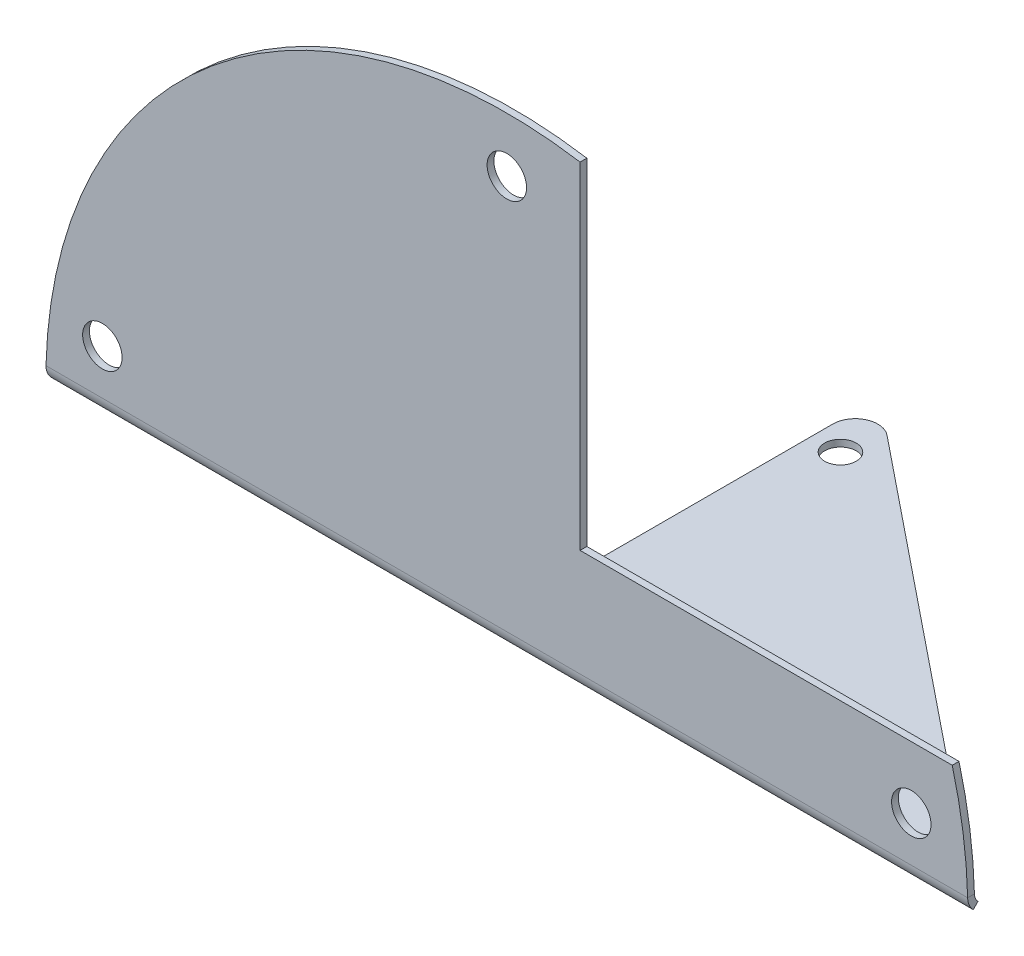
ISO-10303-21;
HEADER;
FILE_DESCRIPTION(('STEP AP214'),'2;1');
FILE_NAME('part.step','',(''),(''),'','','');
FILE_SCHEMA(('AUTOMOTIVE_DESIGN { 1 0 10303 214 1 1 1 1 }'));
ENDSEC;
DATA;
#1=APPLICATION_CONTEXT('core data for automotive mechanical design processes');
#2=APPLICATION_PROTOCOL_DEFINITION('international standard','automotive_design',2000,#1);
#3=PRODUCT_CONTEXT('',#1,'mechanical');
#4=PRODUCT('Part','Part','',(#3));
#5=PRODUCT_RELATED_PRODUCT_CATEGORY('part','',(#4));
#6=PRODUCT_DEFINITION_FORMATION('','',#4);
#7=PRODUCT_DEFINITION_CONTEXT('part definition',#1,'design');
#8=PRODUCT_DEFINITION('design','',#6,#7);
#9=PRODUCT_DEFINITION_SHAPE('','',#8);
#10=(LENGTH_UNIT() NAMED_UNIT(*) SI_UNIT(.MILLI.,.METRE.));
#11=(NAMED_UNIT(*) PLANE_ANGLE_UNIT() SI_UNIT($,.RADIAN.));
#12=(NAMED_UNIT(*) SI_UNIT($,.STERADIAN.) SOLID_ANGLE_UNIT());
#13=UNCERTAINTY_MEASURE_WITH_UNIT(LENGTH_MEASURE(1.E-05),#10,'distance_accuracy_value','');
#14=(GEOMETRIC_REPRESENTATION_CONTEXT(3) GLOBAL_UNCERTAINTY_ASSIGNED_CONTEXT((#13)) GLOBAL_UNIT_ASSIGNED_CONTEXT((#10,
#11,#12)) REPRESENTATION_CONTEXT('',''));
#15=CARTESIAN_POINT('',(0.,0.,0.));
#16=DIRECTION('',(0.,0.,1.));
#17=DIRECTION('',(1.,0.,0.));
#18=AXIS2_PLACEMENT_3D('',#15,#16,#17);
#19=CARTESIAN_POINT('',(0.,-0.0420352248333679,0.600000000000007));
#20=DIRECTION('',(0.,0.,-1.));
#21=DIRECTION('',(0.,1.,0.));
#22=AXIS2_PLACEMENT_3D('',#19,#20,#21);
#23=PLANE('',#22);
#24=CARTESIAN_POINT('',(-35.8867235492184,5.00000000000001,0.599999999999989));
#25=DIRECTION('',(0.,0.,1.));
#26=DIRECTION('',(0.,1.,0.));
#27=AXIS2_PLACEMENT_3D('',#24,#25,#26);
#28=CIRCLE('',#27,1.75);
#29=CARTESIAN_POINT('',(-35.8867235492184,6.75000000000001,0.599999999999983));
#30=VERTEX_POINT('',#29);
#31=EDGE_CURVE('E421',#30,#30,#28,.F.);
#32=ORIENTED_EDGE('',*,*,#31,.T.);
#33=EDGE_LOOP('',(#32));
#34=FACE_BOUND('',#33,.T.);
#35=CARTESIAN_POINT('',(35.8867235492184,5.00000000000001,0.599999999999989));
#36=DIRECTION('',(0.,0.,1.));
#37=DIRECTION('',(0.,1.,0.));
#38=AXIS2_PLACEMENT_3D('',#35,#36,#37);
#39=CIRCLE('',#38,1.75);
#40=CARTESIAN_POINT('',(35.8867235492184,6.75000000000001,0.599999999999983));
#41=VERTEX_POINT('',#40);
#42=EDGE_CURVE('E425',#41,#41,#39,.T.);
#43=ORIENTED_EDGE('',*,*,#42,.F.);
#44=EDGE_LOOP('',(#43));
#45=FACE_BOUND('',#44,.T.);
#46=CARTESIAN_POINT('',(0.,36.,0.59999999999988));
#47=DIRECTION('',(0.,0.,1.));
#48=DIRECTION('',(0.,1.,0.));
#49=AXIS2_PLACEMENT_3D('',#46,#47,#48);
#50=CIRCLE('',#49,1.75);
#51=CARTESIAN_POINT('',(0.,37.75,0.599999999999874));
#52=VERTEX_POINT('',#51);
#53=EDGE_CURVE('E429',#52,#52,#50,.T.);
#54=ORIENTED_EDGE('',*,*,#53,.F.);
#55=EDGE_LOOP('',(#54));
#56=FACE_BOUND('',#55,.T.);
#57=DIRECTION('',(0.,1.,0.));
#58=VECTOR('',#57,1.);
#59=CARTESIAN_POINT('',(6.5,-0.0420352248333679,0.600000000000007));
#60=LINE('',#59,#58);
#61=CARTESIAN_POINT('',(6.5,10.5,0.59999999999997));
#62=VERTEX_POINT('',#61);
#63=CARTESIAN_POINT('',(6.5,40.3381579396377,0.599999999999866));
#64=VERTEX_POINT('',#63);
#65=EDGE_CURVE('E555',#62,#64,#60,.T.);
#66=ORIENTED_EDGE('',*,*,#65,.T.);
#67=CARTESIAN_POINT('',(0.,-0.0420352248333679,0.600000000000007));
#68=DIRECTION('',(0.,0.,1.));
#69=DIRECTION('',(0.,1.,0.));
#70=AXIS2_PLACEMENT_3D('',#67,#68,#69);
#71=CIRCLE('',#70,40.9);
#72=CARTESIAN_POINT('',(-40.8867235492184,1.00000000000001,0.600000000000003));
#73=VERTEX_POINT('',#72);
#74=EDGE_CURVE('E64',#64,#73,#71,.T.);
#75=ORIENTED_EDGE('',*,*,#74,.T.);
#76=DIRECTION('',(1.,0.,0.));
#77=VECTOR('',#76,1.);
#78=CARTESIAN_POINT('',(0.,1.00000000000001,0.600000000000003));
#79=LINE('',#78,#77);
#80=CARTESIAN_POINT('',(40.8867235492184,1.00000000000001,0.600000000000004));
#81=VERTEX_POINT('',#80);
#82=EDGE_CURVE('E438',#73,#81,#79,.T.);
#83=ORIENTED_EDGE('',*,*,#82,.T.);
#84=CARTESIAN_POINT('',(39.5180400996605,10.5,0.59999999999997));
#85=VERTEX_POINT('',#84);
#86=EDGE_CURVE('E516',#81,#85,#71,.T.);
#87=ORIENTED_EDGE('',*,*,#86,.T.);
#88=DIRECTION('',(-1.,0.,0.));
#89=VECTOR('',#88,1.);
#90=CARTESIAN_POINT('',(0.,10.5,0.59999999999997));
#91=LINE('',#90,#89);
#92=EDGE_CURVE('E78',#85,#62,#91,.T.);
#93=ORIENTED_EDGE('',*,*,#92,.T.);
#94=EDGE_LOOP('',(#66,#75,#83,#87,#93));
#95=FACE_BOUND('',#94,.T.);
#96=ADVANCED_FACE('F60',(#34,#45,#56,#95),#23,.F.);
#97=CARTESIAN_POINT('',(0.,-0.04203522483337,0.));
#98=DIRECTION('',(0.,0.,-1.));
#99=DIRECTION('',(0.,1.,0.));
#100=AXIS2_PLACEMENT_3D('',#97,#98,#99);
#101=PLANE('',#100);
#102=CARTESIAN_POINT('',(-35.8867235492184,5.,0.));
#103=DIRECTION('',(0.,0.,-1.));
#104=DIRECTION('',(0.,1.,0.));
#105=AXIS2_PLACEMENT_3D('',#102,#103,#104);
#106=CIRCLE('',#105,1.75);
#107=CARTESIAN_POINT('',(-35.8867235492184,6.75000000000001,0.));
#108=VERTEX_POINT('',#107);
#109=EDGE_CURVE('E388',#108,#108,#106,.T.);
#110=ORIENTED_EDGE('',*,*,#109,.F.);
#111=EDGE_LOOP('',(#110));
#112=FACE_BOUND('',#111,.T.);
#113=CARTESIAN_POINT('',(35.8867235492184,5.,0.));
#114=DIRECTION('',(0.,0.,1.));
#115=DIRECTION('',(0.,1.,0.));
#116=AXIS2_PLACEMENT_3D('',#113,#114,#115);
#117=CIRCLE('',#116,1.75);
#118=CARTESIAN_POINT('',(35.8867235492184,6.75000000000001,0.));
#119=VERTEX_POINT('',#118);
#120=EDGE_CURVE('E392',#119,#119,#117,.T.);
#121=ORIENTED_EDGE('',*,*,#120,.T.);
#122=EDGE_LOOP('',(#121));
#123=FACE_BOUND('',#122,.T.);
#124=CARTESIAN_POINT('',(0.,36.,-1.25693328198353E-13));
#125=DIRECTION('',(0.,0.,1.));
#126=DIRECTION('',(0.,1.,0.));
#127=AXIS2_PLACEMENT_3D('',#124,#125,#126);
#128=CIRCLE('',#127,1.75);
#129=CARTESIAN_POINT('',(0.,37.75,-1.31803420541328E-13));
#130=VERTEX_POINT('',#129);
#131=EDGE_CURVE('E396',#130,#130,#128,.T.);
#132=ORIENTED_EDGE('',*,*,#131,.T.);
#133=EDGE_LOOP('',(#132));
#134=FACE_BOUND('',#133,.T.);
#135=CARTESIAN_POINT('',(0.,-0.04203522483337,0.));
#136=DIRECTION('',(0.,0.,1.));
#137=DIRECTION('',(0.,1.,0.));
#138=AXIS2_PLACEMENT_3D('',#135,#136,#137);
#139=CIRCLE('',#138,40.9);
#140=CARTESIAN_POINT('',(6.5,40.3381579396377,-1.33939376771476E-13));
#141=VERTEX_POINT('',#140);
#142=CARTESIAN_POINT('',(-40.8867235492184,1.,0.));
#143=VERTEX_POINT('',#142);
#144=EDGE_CURVE('E348',#141,#143,#139,.T.);
#145=ORIENTED_EDGE('',*,*,#144,.F.);
#146=DIRECTION('',(0.,1.,0.));
#147=VECTOR('',#146,1.);
#148=CARTESIAN_POINT('',(6.5,-0.04203522483337,0.));
#149=LINE('',#148,#147);
#150=CARTESIAN_POINT('',(6.5,10.5,0.));
#151=VERTEX_POINT('',#150);
#152=EDGE_CURVE('E402',#151,#141,#149,.T.);
#153=ORIENTED_EDGE('',*,*,#152,.F.);
#154=DIRECTION('',(1.,0.,0.));
#155=VECTOR('',#154,1.);
#156=CARTESIAN_POINT('',(0.,10.5,0.));
#157=LINE('',#156,#155);
#158=CARTESIAN_POINT('',(39.5180400996605,10.5,0.));
#159=VERTEX_POINT('',#158);
#160=EDGE_CURVE('E415',#159,#151,#157,.F.);
#161=ORIENTED_EDGE('',*,*,#160,.F.);
#162=CARTESIAN_POINT('',(40.8867235492184,1.,0.));
#163=VERTEX_POINT('',#162);
#164=EDGE_CURVE('E345',#163,#159,#139,.T.);
#165=ORIENTED_EDGE('',*,*,#164,.F.);
#166=DIRECTION('',(1.,0.,0.));
#167=VECTOR('',#166,1.);
#168=CARTESIAN_POINT('',(0.,1.,0.));
#169=LINE('',#168,#167);
#170=EDGE_CURVE('E343',#143,#163,#169,.T.);
#171=ORIENTED_EDGE('',*,*,#170,.F.);
#172=EDGE_LOOP('',(#145,#153,#161,#165,#171));
#173=FACE_BOUND('',#172,.T.);
#174=ADVANCED_FACE('F375',(#112,#123,#134,#173),#101,.T.);
#175=CARTESIAN_POINT('',(0.,-0.0420352248333679,0.600000000000007));
#176=DIRECTION('',(0.,0.,-1.));
#177=DIRECTION('',(0.,1.,0.));
#178=AXIS2_PLACEMENT_3D('',#175,#176,#177);
#179=CYLINDRICAL_SURFACE('',#178,40.9);
#180=ORIENTED_EDGE('',*,*,#74,.F.);
#181=DIRECTION('',(0.,0.,1.));
#182=VECTOR('',#181,1.);
#183=CARTESIAN_POINT('',(6.5,40.3381579396377,0.599999999999866));
#184=LINE('',#183,#182);
#185=EDGE_CURVE('E407',#64,#141,#184,.F.);
#186=ORIENTED_EDGE('',*,*,#185,.T.);
#187=ORIENTED_EDGE('',*,*,#144,.T.);
#188=CARTESIAN_POINT('',(-40.8867235492184,1.,0.600000000000003));
#189=CARTESIAN_POINT('',(-40.8867235492184,1.,0.));
#190=B_SPLINE_CURVE_WITH_KNOTS('',1,(#188,#189),.UNSPECIFIED.,.F.,.F.,(2,2),(0.,1.),.UNSPECIFIED.);
#191=EDGE_CURVE('E362',#73,#143,#190,.T.);
#192=ORIENTED_EDGE('',*,*,#191,.F.);
#193=EDGE_LOOP('',(#180,#186,#187,#192));
#194=FACE_BOUND('',#193,.T.);
#195=ADVANCED_FACE('F365',(#194),#179,.T.);
#196=ORIENTED_EDGE('',*,*,#164,.T.);
#197=DIRECTION('',(0.,0.,1.));
#198=VECTOR('',#197,1.);
#199=CARTESIAN_POINT('',(39.5180400996605,10.5,0.59999999999997));
#200=LINE('',#199,#198);
#201=EDGE_CURVE('E410',#85,#159,#200,.F.);
#202=ORIENTED_EDGE('',*,*,#201,.F.);
#203=ORIENTED_EDGE('',*,*,#86,.F.);
#204=CARTESIAN_POINT('',(40.8867235492184,1.,0.));
#205=CARTESIAN_POINT('',(40.8867235492184,1.,0.600000000000003));
#206=B_SPLINE_CURVE_WITH_KNOTS('',1,(#204,#205),.UNSPECIFIED.,.F.,.F.,(2,2),(0.,1.),.UNSPECIFIED.);
#207=EDGE_CURVE('E193',#163,#81,#206,.T.);
#208=ORIENTED_EDGE('',*,*,#207,.F.);
#209=EDGE_LOOP('',(#196,#202,#203,#208));
#210=FACE_BOUND('',#209,.T.);
#211=ADVANCED_FACE('F374',(#210),#179,.T.);
#212=CARTESIAN_POINT('',(-0.5,-0.6,-30.817766741711));
#213=DIRECTION('',(0.,1.,0.));
#214=DIRECTION('',(0.,0.,1.));
#215=AXIS2_PLACEMENT_3D('',#212,#213,#214);
#216=CYLINDRICAL_SURFACE('',#215,2.);
#217=CARTESIAN_POINT('',(-0.5,0.,-30.817766741711));
#218=DIRECTION('',(0.,-1.,0.));
#219=DIRECTION('',(0.,0.,-1.));
#220=AXIS2_PLACEMENT_3D('',#217,#218,#219);
#221=CIRCLE('',#220,2.);
#222=CARTESIAN_POINT('',(-2.5,0.,-30.817766741711));
#223=VERTEX_POINT('',#222);
#224=CARTESIAN_POINT('',(0.755504902379564,0.,-32.3745928206616));
#225=VERTEX_POINT('',#224);
#226=EDGE_CURVE('E461',#223,#225,#221,.T.);
#227=ORIENTED_EDGE('',*,*,#226,.T.);
#228=DIRECTION('',(0.,1.,0.));
#229=VECTOR('',#228,1.);
#230=CARTESIAN_POINT('',(0.755504902379564,-0.6,-32.3745928206616));
#231=LINE('',#230,#229);
#232=CARTESIAN_POINT('',(0.755504902379564,-0.6,-32.3745928206616));
#233=VERTEX_POINT('',#232);
#234=EDGE_CURVE('E467',#233,#225,#231,.T.);
#235=ORIENTED_EDGE('',*,*,#234,.F.);
#236=CARTESIAN_POINT('',(-0.5,-0.6,-30.817766741711));
#237=DIRECTION('',(0.,-1.,0.));
#238=DIRECTION('',(0.,0.,-1.));
#239=AXIS2_PLACEMENT_3D('',#236,#237,#238);
#240=CIRCLE('',#239,2.);
#241=CARTESIAN_POINT('',(-2.5,-0.6,-30.817766741711));
#242=VERTEX_POINT('',#241);
#243=EDGE_CURVE('E470',#242,#233,#240,.T.);
#244=ORIENTED_EDGE('',*,*,#243,.F.);
#245=DIRECTION('',(0.,1.,0.));
#246=VECTOR('',#245,1.);
#247=CARTESIAN_POINT('',(-2.5,-0.6,-30.817766741711));
#248=LINE('',#247,#246);
#249=EDGE_CURVE('E12',#242,#223,#248,.T.);
#250=ORIENTED_EDGE('',*,*,#249,.T.);
#251=EDGE_LOOP('',(#227,#235,#244,#250));
#252=FACE_BOUND('',#251,.T.);
#253=ADVANCED_FACE('F538',(#252),#216,.T.);
#254=CARTESIAN_POINT('',(0.,-0.6,0.));
#255=DIRECTION('',(0.,1.,0.));
#256=DIRECTION('',(0.,0.,1.));
#257=AXIS2_PLACEMENT_3D('',#254,#255,#256);
#258=PLANE('',#257);
#259=CARTESIAN_POINT('',(0.,-0.6,-29.));
#260=DIRECTION('',(0.,-1.,0.));
#261=DIRECTION('',(0.,0.,1.));
#262=AXIS2_PLACEMENT_3D('',#259,#260,#261);
#263=CIRCLE('',#262,1.4);
#264=CARTESIAN_POINT('',(0.,-0.6,-27.6));
#265=VERTEX_POINT('',#264);
#266=EDGE_CURVE('E435',#265,#265,#263,.T.);
#267=ORIENTED_EDGE('',*,*,#266,.F.);
#268=EDGE_LOOP('',(#267));
#269=FACE_BOUND('',#268,.T.);
#270=DIRECTION('',(0.,0.,-1.));
#271=VECTOR('',#270,1.);
#272=CARTESIAN_POINT('',(-2.5,-0.6,0.));
#273=LINE('',#272,#271);
#274=CARTESIAN_POINT('',(-2.5,-0.6,-0.999999999999997));
#275=VERTEX_POINT('',#274);
#276=EDGE_CURVE('E70',#275,#242,#273,.T.);
#277=ORIENTED_EDGE('',*,*,#276,.T.);
#278=ORIENTED_EDGE('',*,*,#243,.T.);
#279=DIRECTION('',(0.778413039475329,0.,0.627752451189782));
#280=VECTOR('',#279,1.);
#281=CARTESIAN_POINT('',(40.9,-0.6,0.));
#282=LINE('',#281,#280);
#283=CARTESIAN_POINT('',(39.66,-0.6,-0.999999999999998));
#284=VERTEX_POINT('',#283);
#285=EDGE_CURVE('E466',#233,#284,#282,.T.);
#286=ORIENTED_EDGE('',*,*,#285,.T.);
#287=DIRECTION('',(1.,0.,0.));
#288=VECTOR('',#287,1.);
#289=CARTESIAN_POINT('',(0.,-0.6,-0.999999999999997));
#290=LINE('',#289,#288);
#291=EDGE_CURVE('E168',#275,#284,#290,.T.);
#292=ORIENTED_EDGE('',*,*,#291,.F.);
#293=EDGE_LOOP('',(#277,#278,#286,#292));
#294=FACE_BOUND('',#293,.T.);
#295=ADVANCED_FACE('F498',(#269,#294),#258,.F.);
#296=CARTESIAN_POINT('',(40.9,-0.6,0.));
#297=DIRECTION('',(0.627752451189782,0.,-0.778413039475329));
#298=DIRECTION('',(0.778413039475329,0.,0.627752451189782));
#299=AXIS2_PLACEMENT_3D('',#296,#297,#298);
#300=PLANE('',#299);
#301=CARTESIAN_POINT('',(39.66,-0.6,-0.999999999999998));
#302=CARTESIAN_POINT('',(39.66,0.,-0.999999999999998));
#303=B_SPLINE_CURVE_WITH_KNOTS('',1,(#301,#302),.UNSPECIFIED.,.F.,.F.,(2,2),(0.,1.),.UNSPECIFIED.);
#304=CARTESIAN_POINT('',(39.66,0.,-0.999999999999998));
#305=VERTEX_POINT('',#304);
#306=EDGE_CURVE('E258',#305,#284,#303,.F.);
#307=ORIENTED_EDGE('',*,*,#306,.T.);
#308=ORIENTED_EDGE('',*,*,#285,.F.);
#309=ORIENTED_EDGE('',*,*,#234,.T.);
#310=DIRECTION('',(0.778413039475329,0.,0.627752451189782));
#311=VECTOR('',#310,1.);
#312=CARTESIAN_POINT('',(40.9,0.,0.));
#313=LINE('',#312,#311);
#314=EDGE_CURVE('E460',#225,#305,#313,.T.);
#315=ORIENTED_EDGE('',*,*,#314,.T.);
#316=EDGE_LOOP('',(#307,#308,#309,#315));
#317=FACE_BOUND('',#316,.T.);
#318=ADVANCED_FACE('F488',(#317),#300,.T.);
#319=CARTESIAN_POINT('',(0.,0.,0.));
#320=DIRECTION('',(0.,1.,0.));
#321=DIRECTION('',(0.,0.,1.));
#322=AXIS2_PLACEMENT_3D('',#319,#320,#321);
#323=PLANE('',#322);
#324=CARTESIAN_POINT('',(0.,0.,-29.));
#325=DIRECTION('',(0.,-1.,0.));
#326=DIRECTION('',(0.,0.,1.));
#327=AXIS2_PLACEMENT_3D('',#324,#325,#326);
#328=CIRCLE('',#327,1.4);
#329=CARTESIAN_POINT('',(0.,0.,-27.6));
#330=VERTEX_POINT('',#329);
#331=EDGE_CURVE('E432',#330,#330,#328,.T.);
#332=ORIENTED_EDGE('',*,*,#331,.T.);
#333=EDGE_LOOP('',(#332));
#334=FACE_BOUND('',#333,.T.);
#335=DIRECTION('',(1.,0.,0.));
#336=VECTOR('',#335,1.);
#337=CARTESIAN_POINT('',(0.,0.,-0.999999999999997));
#338=LINE('',#337,#336);
#339=CARTESIAN_POINT('',(-2.5,0.,-0.999999999999997));
#340=VERTEX_POINT('',#339);
#341=EDGE_CURVE('E448',#340,#305,#338,.T.);
#342=ORIENTED_EDGE('',*,*,#341,.T.);
#343=ORIENTED_EDGE('',*,*,#314,.F.);
#344=ORIENTED_EDGE('',*,*,#226,.F.);
#345=DIRECTION('',(0.,0.,-1.));
#346=VECTOR('',#345,1.);
#347=CARTESIAN_POINT('',(-2.5,0.,0.));
#348=LINE('',#347,#346);
#349=EDGE_CURVE('E464',#340,#223,#348,.T.);
#350=ORIENTED_EDGE('',*,*,#349,.F.);
#351=EDGE_LOOP('',(#342,#343,#344,#350));
#352=FACE_BOUND('',#351,.T.);
#353=ADVANCED_FACE('F497',(#334,#352),#323,.T.);
#354=CARTESIAN_POINT('',(-2.5,-0.6,0.));
#355=DIRECTION('',(-1.,0.,0.));
#356=DIRECTION('',(0.,0.,-1.));
#357=AXIS2_PLACEMENT_3D('',#354,#355,#356);
#358=PLANE('',#357);
#359=DIRECTION('',(0.,1.,0.));
#360=VECTOR('',#359,1.);
#361=CARTESIAN_POINT('',(-2.5,-0.6,-0.999999999999997));
#362=LINE('',#361,#360);
#363=EDGE_CURVE('E472',#275,#340,#362,.T.);
#364=ORIENTED_EDGE('',*,*,#363,.T.);
#365=ORIENTED_EDGE('',*,*,#349,.T.);
#366=ORIENTED_EDGE('',*,*,#249,.F.);
#367=ORIENTED_EDGE('',*,*,#276,.F.);
#368=EDGE_LOOP('',(#364,#365,#366,#367));
#369=FACE_BOUND('',#368,.T.);
#370=ADVANCED_FACE('F62',(#369),#358,.T.);
#371=CARTESIAN_POINT('',(-40.9,-0.149513513285818,0.112932469996856));
#372=CARTESIAN_POINT('',(-40.89778682558,-0.000803054612772406,0.26653090154597));
#373=CARTESIAN_POINT('',(-40.8955745164061,0.178964943287356,0.389816839267624));
#374=CARTESIAN_POINT('',(-40.8911490328122,0.572589584931808,0.556601987713694));
#375=CARTESIAN_POINT('',(-40.8889367236384,0.786207393268396,0.600000000000003));
#376=CARTESIAN_POINT('',(-40.8867235492184,1.,0.600000000000003));
#377=CARTESIAN_POINT('',(-40.9,0.281554054196364,-0.304417206251963));
#378=CARTESIAN_POINT('',(-40.8977868256523,0.374498087830562,-0.208418189670029));
#379=CARTESIAN_POINT('',(-40.8955745164061,0.486853089554597,-0.131364475457734));
#380=CARTESIAN_POINT('',(-40.8911490328122,0.73286849058238,-0.0271237576789403));
#381=CARTESIAN_POINT('',(-40.8889367235661,0.866379625158088,0.));
#382=CARTESIAN_POINT('',(-40.8867235492184,1.,0.));
#383=B_SPLINE_SURFACE_WITH_KNOTS('',1,3,((#371,#372,#373,#374,#375,#376),(#377,#378,#379,#380,
#381,#382)),.UNSPECIFIED.,.F.,.F.,.F.,(2,2),(4,2,4),(0.,1.),(0.,0.5,1.),.UNSPECIFIED.);
#384=CARTESIAN_POINT('',(-40.9,0.281554054196364,-0.304417206251963));
#385=CARTESIAN_POINT('',(-40.9,-0.149513513285818,0.112932469996856));
#386=B_SPLINE_CURVE_WITH_KNOTS('',1,(#384,#385),.UNSPECIFIED.,.F.,.F.,(2,2),(0.,1.),.UNSPECIFIED.);
#387=CARTESIAN_POINT('',(-40.9,0.281554054196364,-0.304417206251963));
#388=VERTEX_POINT('',#387);
#389=CARTESIAN_POINT('',(-40.9,-0.149513513285818,0.112932469996856));
#390=VERTEX_POINT('',#389);
#391=EDGE_CURVE('E186',#388,#390,#386,.T.);
#392=CARTESIAN_POINT('',(-40.9,-0.149513513285818,0.112932469996856));
#393=CARTESIAN_POINT('',(-40.89778682558,-0.000803054612772406,0.26653090154597));
#394=CARTESIAN_POINT('',(-40.8955745164061,0.178964943287356,0.389816839267624));
#395=CARTESIAN_POINT('',(-40.8911490328122,0.572589584931808,0.556601987713694));
#396=CARTESIAN_POINT('',(-40.8889367236384,0.786207393268396,0.600000000000003));
#397=CARTESIAN_POINT('',(-40.8867235492184,1.,0.600000000000003));
#398=B_SPLINE_CURVE_WITH_KNOTS('',3,(#392,#393,#394,#395,#396,#397),.UNSPECIFIED.,.F.,.F.,(4,2,
4),(0.,0.5,1.),.UNSPECIFIED.);
#399=EDGE_CURVE('E197',#390,#73,#398,.T.);
#400=CARTESIAN_POINT('',(-40.8867235492184,1.,0.));
#401=CARTESIAN_POINT('',(-40.8889367235661,0.866379625158088,0.));
#402=CARTESIAN_POINT('',(-40.8911490328122,0.73286849058238,-0.0271237576789403));
#403=CARTESIAN_POINT('',(-40.8955745164061,0.486853089554597,-0.131364475457734));
#404=CARTESIAN_POINT('',(-40.8977868256523,0.374498087830562,-0.208418189670029));
#405=CARTESIAN_POINT('',(-40.9,0.281554054196364,-0.304417206251963));
#406=B_SPLINE_CURVE_WITH_KNOTS('',3,(#400,#401,#402,#403,#404,#405),.UNSPECIFIED.,.F.,.F.,(4,2,
4),(0.,0.5,1.),.UNSPECIFIED.);
#407=EDGE_CURVE('E271',#388,#143,#406,.F.);
#408=ORIENTED_EDGE('',*,*,#391,.T.);
#409=ORIENTED_EDGE('',*,*,#399,.T.);
#410=ORIENTED_EDGE('',*,*,#191,.T.);
#411=ORIENTED_EDGE('',*,*,#407,.F.);
#412=EDGE_LOOP('',(#408,#409,#410,#411));
#413=FACE_BOUND('',#412,.T.);
#414=ADVANCED_FACE('F220',(#413),#383,.F.);
#415=CARTESIAN_POINT('',(40.8867235492184,1.,0.600000000000003));
#416=CARTESIAN_POINT('',(40.8889367236384,0.786207393268393,0.600000000000003));
#417=CARTESIAN_POINT('',(40.8911490328122,0.572589584931805,0.556601987713693));
#418=CARTESIAN_POINT('',(40.8955745164061,0.178964943287349,0.389816839267621));
#419=CARTESIAN_POINT('',(40.89778682558,-0.000803054612781297,0.266530901545963));
#420=CARTESIAN_POINT('',(40.9,-0.149513513285826,0.112932469996847));
#421=CARTESIAN_POINT('',(40.8867235492184,1.,0.));
#422=CARTESIAN_POINT('',(40.8889367235661,0.866379625158086,0.));
#423=CARTESIAN_POINT('',(40.8911490328122,0.732868490582378,-0.0271237576789407));
#424=CARTESIAN_POINT('',(40.8955745164061,0.486853089554593,-0.131364475457736));
#425=CARTESIAN_POINT('',(40.8977868256523,0.374498087830556,-0.208418189670033));
#426=CARTESIAN_POINT('',(40.9,0.281554054196358,-0.304417206251969));
#427=B_SPLINE_SURFACE_WITH_KNOTS('',1,3,((#415,#416,#417,#418,#419,#420),(#421,#422,#423,#424,
#425,#426)),.UNSPECIFIED.,.F.,.F.,.F.,(2,2),(4,2,4),(0.,1.),(0.,0.5,1.),.UNSPECIFIED.);
#428=CARTESIAN_POINT('',(40.8867235492184,1.,0.600000000000003));
#429=CARTESIAN_POINT('',(40.8889367236384,0.786207393268393,0.600000000000003));
#430=CARTESIAN_POINT('',(40.8911490328122,0.572589584931805,0.556601987713693));
#431=CARTESIAN_POINT('',(40.8955745164061,0.178964943287349,0.389816839267621));
#432=CARTESIAN_POINT('',(40.89778682558,-0.000803054612781297,0.266530901545963));
#433=CARTESIAN_POINT('',(40.9,-0.149513513285826,0.112932469996847));
#434=B_SPLINE_CURVE_WITH_KNOTS('',3,(#428,#429,#430,#431,#432,#433),.UNSPECIFIED.,.F.,.F.,(4,2,
4),(0.,0.5,1.),.UNSPECIFIED.);
#435=CARTESIAN_POINT('',(40.9,-0.149513513285826,0.112932469996847));
#436=VERTEX_POINT('',#435);
#437=EDGE_CURVE('E165',#81,#436,#434,.T.);
#438=CARTESIAN_POINT('',(40.9,0.281554054196362,-0.304417206251965));
#439=CARTESIAN_POINT('',(40.9,-0.149513513285821,0.112932469996853));
#440=B_SPLINE_CURVE_WITH_KNOTS('',1,(#438,#439),.UNSPECIFIED.,.F.,.F.,(2,2),(0.,1.),.UNSPECIFIED.);
#441=CARTESIAN_POINT('',(40.9,0.281554054196358,-0.304417206251969));
#442=VERTEX_POINT('',#441);
#443=EDGE_CURVE('E178',#442,#436,#440,.T.);
#444=CARTESIAN_POINT('',(40.9,0.281554054196358,-0.304417206251969));
#445=CARTESIAN_POINT('',(40.8977868256523,0.374498087830556,-0.208418189670033));
#446=CARTESIAN_POINT('',(40.8955745164061,0.486853089554593,-0.131364475457736));
#447=CARTESIAN_POINT('',(40.8911490328122,0.732868490582378,-0.0271237576789407));
#448=CARTESIAN_POINT('',(40.8889367235661,0.866379625158086,0.));
#449=CARTESIAN_POINT('',(40.8867235492184,1.,0.));
#450=B_SPLINE_CURVE_WITH_KNOTS('',3,(#444,#445,#446,#447,#448,#449),.UNSPECIFIED.,.F.,.F.,(4,2,
4),(0.,0.5,1.),.UNSPECIFIED.);
#451=EDGE_CURVE('E339',#163,#442,#450,.F.);
#452=ORIENTED_EDGE('',*,*,#207,.T.);
#453=ORIENTED_EDGE('',*,*,#437,.T.);
#454=ORIENTED_EDGE('',*,*,#443,.F.);
#455=ORIENTED_EDGE('',*,*,#451,.F.);
#456=EDGE_LOOP('',(#452,#453,#454,#455));
#457=FACE_BOUND('',#456,.T.);
#458=ADVANCED_FACE('F191',(#457),#427,.F.);
#459=CARTESIAN_POINT('',(40.9,-0.149513513285821,0.112932469996853));
#460=CARTESIAN_POINT('',(40.6933163118829,-0.292208914975817,-0.0344531953048908));
#461=CARTESIAN_POINT('',(40.4866666666667,-0.406143850153705,-0.209533648272086));
#462=CARTESIAN_POINT('',(40.0733333333333,-0.560073141658362,-0.58981787799158));
#463=CARTESIAN_POINT('',(39.8666836881172,-0.6,-0.794854900131852));
#464=CARTESIAN_POINT('',(39.66,-0.6,-0.999999999999998));
#465=CARTESIAN_POINT('',(40.9,0.281554054196362,-0.304417206251965));
#466=CARTESIAN_POINT('',(40.6933238019284,0.192372660117027,-0.396529908856602));
#467=CARTESIAN_POINT('',(40.4866666666667,0.121160093653935,-0.505958530170052));
#468=CARTESIAN_POINT('',(40.0733333333333,0.024954286463524,-0.743636173744736));
#469=CARTESIAN_POINT('',(39.8666761980716,0.,-0.871788959012624));
#470=CARTESIAN_POINT('',(39.66,0.,-0.999999999999998));
#471=B_SPLINE_SURFACE_WITH_KNOTS('',1,3,((#459,#460,#461,#462,#463,#464),(#465,#466,#467,#468,
#469,#470)),.UNSPECIFIED.,.F.,.F.,.F.,(2,2),(4,2,4),(0.,1.),(0.,0.5,1.),.UNSPECIFIED.);
#472=CARTESIAN_POINT('',(40.9,-0.149513513285821,0.112932469996853));
#473=CARTESIAN_POINT('',(40.6933163118829,-0.292208914975817,-0.0344531953048908));
#474=CARTESIAN_POINT('',(40.4866666666667,-0.406143850153705,-0.209533648272086));
#475=CARTESIAN_POINT('',(40.0733333333333,-0.560073141658362,-0.58981787799158));
#476=CARTESIAN_POINT('',(39.8666836881172,-0.6,-0.794854900131852));
#477=CARTESIAN_POINT('',(39.66,-0.6,-0.999999999999998));
#478=B_SPLINE_CURVE_WITH_KNOTS('',3,(#472,#473,#474,#475,#476,#477),.UNSPECIFIED.,.F.,.F.,(4,2,
4),(0.,0.5,1.),.UNSPECIFIED.);
#479=EDGE_CURVE('E159',#436,#284,#478,.T.);
#480=CARTESIAN_POINT('',(39.66,0.,-0.999999999999998));
#481=CARTESIAN_POINT('',(39.8666761980716,0.,-0.871788959012624));
#482=CARTESIAN_POINT('',(40.0733333333333,0.024954286463524,-0.743636173744736));
#483=CARTESIAN_POINT('',(40.4866666666667,0.121160093653935,-0.505958530170052));
#484=CARTESIAN_POINT('',(40.6933238019284,0.192372660117027,-0.396529908856602));
#485=CARTESIAN_POINT('',(40.9,0.281554054196362,-0.304417206251965));
#486=B_SPLINE_CURVE_WITH_KNOTS('',3,(#480,#481,#482,#483,#484,#485),.UNSPECIFIED.,.F.,.F.,(4,2,
4),(0.,0.5,1.),.UNSPECIFIED.);
#487=EDGE_CURVE('E181',#442,#305,#486,.F.);
#488=ORIENTED_EDGE('',*,*,#443,.T.);
#489=ORIENTED_EDGE('',*,*,#479,.T.);
#490=ORIENTED_EDGE('',*,*,#306,.F.);
#491=ORIENTED_EDGE('',*,*,#487,.F.);
#492=EDGE_LOOP('',(#488,#489,#490,#491));
#493=FACE_BOUND('',#492,.T.);
#494=ADVANCED_FACE('F180',(#493),#471,.F.);
#495=CARTESIAN_POINT('',(-2.5,1.,-0.999999999999997));
#496=DIRECTION('',(-1.,0.,0.));
#497=DIRECTION('',(0.,0.,-1.));
#498=AXIS2_PLACEMENT_3D('',#495,#496,#497);
#499=PLANE('',#498);
#500=ORIENTED_EDGE('',*,*,#363,.F.);
#501=CARTESIAN_POINT('',(-2.5,1.,-0.999999999999997));
#502=DIRECTION('',(-1.,0.,0.));
#503=DIRECTION('',(0.,0.,-1.));
#504=AXIS2_PLACEMENT_3D('',#501,#502,#503);
#505=CIRCLE('',#504,1.6);
#506=CARTESIAN_POINT('',(-2.5,-0.14951351328582,0.112932469996854));
#507=VERTEX_POINT('',#506);
#508=EDGE_CURVE('E112',#275,#507,#505,.T.);
#509=ORIENTED_EDGE('',*,*,#508,.T.);
#510=DIRECTION('',(0.,-0.718445945803637,0.695582793748032));
#511=VECTOR('',#510,1.);
#512=CARTESIAN_POINT('',(-2.5,-0.14951351328582,0.112932469996854));
#513=LINE('',#512,#511);
#514=CARTESIAN_POINT('',(-2.5,0.281554054196362,-0.304417206251965));
#515=VERTEX_POINT('',#514);
#516=EDGE_CURVE('E187',#515,#507,#513,.T.);
#517=ORIENTED_EDGE('',*,*,#516,.F.);
#518=CARTESIAN_POINT('',(-2.5,1.,-0.999999999999997));
#519=DIRECTION('',(-1.,0.,0.));
#520=DIRECTION('',(0.,0.,1.));
#521=AXIS2_PLACEMENT_3D('',#518,#519,#520);
#522=CIRCLE('',#521,1.);
#523=EDGE_CURVE('E286',#340,#515,#522,.T.);
#524=ORIENTED_EDGE('',*,*,#523,.F.);
#525=EDGE_LOOP('',(#500,#509,#517,#524));
#526=FACE_BOUND('',#525,.T.);
#527=ADVANCED_FACE('F303',(#526),#499,.T.);
#528=CARTESIAN_POINT('',(-21.7,-0.14951351328582,0.112932469996854));
#529=DIRECTION('',(0.,-0.695582793748032,-0.718445945803637));
#530=DIRECTION('',(-1.,0.,0.));
#531=AXIS2_PLACEMENT_3D('',#528,#529,#530);
#532=PLANE('',#531);
#533=DIRECTION('',(1.,0.,0.));
#534=VECTOR('',#533,1.);
#535=CARTESIAN_POINT('',(-63.2476842386454,0.281554054196362,-0.304417206251965));
#536=LINE('',#535,#534);
#537=EDGE_CURVE('E134',#515,#388,#536,.F.);
#538=ORIENTED_EDGE('',*,*,#537,.F.);
#539=ORIENTED_EDGE('',*,*,#516,.T.);
#540=DIRECTION('',(-1.,0.,0.));
#541=VECTOR('',#540,1.);
#542=CARTESIAN_POINT('',(-40.9,-0.14951351328582,0.112932469996854));
#543=LINE('',#542,#541);
#544=EDGE_CURVE('E118',#507,#390,#543,.T.);
#545=ORIENTED_EDGE('',*,*,#544,.T.);
#546=ORIENTED_EDGE('',*,*,#391,.F.);
#547=EDGE_LOOP('',(#538,#539,#545,#546));
#548=FACE_BOUND('',#547,.T.);
#549=ADVANCED_FACE('F530',(#548),#532,.T.);
#550=CARTESIAN_POINT('',(-63.2476842386454,1.,-0.999999999999997));
#551=DIRECTION('',(1.,0.,0.));
#552=DIRECTION('',(0.,0.,1.));
#553=AXIS2_PLACEMENT_3D('',#550,#551,#552);
#554=CYLINDRICAL_SURFACE('',#553,1.6);
#555=ORIENTED_EDGE('',*,*,#508,.F.);
#556=ORIENTED_EDGE('',*,*,#291,.T.);
#557=ORIENTED_EDGE('',*,*,#479,.F.);
#558=ORIENTED_EDGE('',*,*,#437,.F.);
#559=ORIENTED_EDGE('',*,*,#82,.F.);
#560=ORIENTED_EDGE('',*,*,#399,.F.);
#561=ORIENTED_EDGE('',*,*,#544,.F.);
#562=EDGE_LOOP('',(#555,#556,#557,#558,#559,#560,#561));
#563=FACE_BOUND('',#562,.T.);
#564=ADVANCED_FACE('F162',(#563),#554,.T.);
#565=CARTESIAN_POINT('',(-63.2476842386454,1.,-0.999999999999997));
#566=DIRECTION('',(1.,0.,0.));
#567=DIRECTION('',(0.,0.,1.));
#568=AXIS2_PLACEMENT_3D('',#565,#566,#567);
#569=CYLINDRICAL_SURFACE('',#568,1.);
#570=ORIENTED_EDGE('',*,*,#523,.T.);
#571=ORIENTED_EDGE('',*,*,#537,.T.);
#572=ORIENTED_EDGE('',*,*,#407,.T.);
#573=ORIENTED_EDGE('',*,*,#170,.T.);
#574=ORIENTED_EDGE('',*,*,#451,.T.);
#575=ORIENTED_EDGE('',*,*,#487,.T.);
#576=ORIENTED_EDGE('',*,*,#341,.F.);
#577=EDGE_LOOP('',(#570,#571,#572,#573,#574,#575,#576));
#578=FACE_BOUND('',#577,.T.);
#579=ADVANCED_FACE('F291',(#578),#569,.F.);
#580=CARTESIAN_POINT('',(0.,-10.,-29.));
#581=DIRECTION('',(0.,1.,0.));
#582=DIRECTION('',(0.,0.,1.));
#583=AXIS2_PLACEMENT_3D('',#580,#581,#582);
#584=CYLINDRICAL_SURFACE('',#583,1.4);
#585=ORIENTED_EDGE('',*,*,#331,.F.);
#586=EDGE_LOOP('',(#585));
#587=FACE_BOUND('',#586,.T.);
#588=ORIENTED_EDGE('',*,*,#266,.T.);
#589=EDGE_LOOP('',(#588));
#590=FACE_BOUND('',#589,.T.);
#591=ADVANCED_FACE('F300',(#587,#590),#584,.F.);
#592=CARTESIAN_POINT('',(0.,36.,9.99999999999988));
#593=DIRECTION('',(0.,0.,-1.));
#594=DIRECTION('',(0.,1.,0.));
#595=AXIS2_PLACEMENT_3D('',#592,#593,#594);
#596=CYLINDRICAL_SURFACE('',#595,1.75);
#597=ORIENTED_EDGE('',*,*,#131,.F.);
#598=EDGE_LOOP('',(#597));
#599=FACE_BOUND('',#598,.T.);
#600=ORIENTED_EDGE('',*,*,#53,.T.);
#601=EDGE_LOOP('',(#600));
#602=FACE_BOUND('',#601,.T.);
#603=ADVANCED_FACE('F574',(#599,#602),#596,.F.);
#604=CARTESIAN_POINT('',(35.8867235492184,5.00000000000004,9.99999999999998));
#605=DIRECTION('',(0.,0.,-1.));
#606=DIRECTION('',(0.,1.,0.));
#607=AXIS2_PLACEMENT_3D('',#604,#605,#606);
#608=CYLINDRICAL_SURFACE('',#607,1.75);
#609=ORIENTED_EDGE('',*,*,#120,.F.);
#610=EDGE_LOOP('',(#609));
#611=FACE_BOUND('',#610,.T.);
#612=ORIENTED_EDGE('',*,*,#42,.T.);
#613=EDGE_LOOP('',(#612));
#614=FACE_BOUND('',#613,.T.);
#615=ADVANCED_FACE('F570',(#611,#614),#608,.F.);
#616=CARTESIAN_POINT('',(-35.8867235492184,5.00000000000004,9.99999999999998));
#617=DIRECTION('',(0.,0.,-1.));
#618=DIRECTION('',(0.,1.,0.));
#619=AXIS2_PLACEMENT_3D('',#616,#617,#618);
#620=CYLINDRICAL_SURFACE('',#619,1.75);
#621=ORIENTED_EDGE('',*,*,#109,.T.);
#622=EDGE_LOOP('',(#621));
#623=FACE_BOUND('',#622,.T.);
#624=ORIENTED_EDGE('',*,*,#31,.F.);
#625=EDGE_LOOP('',(#624));
#626=FACE_BOUND('',#625,.T.);
#627=ADVANCED_FACE('F565',(#623,#626),#620,.F.);
#628=CARTESIAN_POINT('',(6.5,-0.0420352248333679,0.600000000000007));
#629=DIRECTION('',(-1.,0.,0.));
#630=DIRECTION('',(0.,1.,0.));
#631=AXIS2_PLACEMENT_3D('',#628,#629,#630);
#632=PLANE('',#631);
#633=ORIENTED_EDGE('',*,*,#185,.F.);
#634=ORIENTED_EDGE('',*,*,#65,.F.);
#635=DIRECTION('',(0.,0.,1.));
#636=VECTOR('',#635,1.);
#637=CARTESIAN_POINT('',(6.5,10.5,0.59999999999997));
#638=LINE('',#637,#636);
#639=EDGE_CURVE('E411',#62,#151,#638,.F.);
#640=ORIENTED_EDGE('',*,*,#639,.T.);
#641=ORIENTED_EDGE('',*,*,#152,.T.);
#642=EDGE_LOOP('',(#633,#634,#640,#641));
#643=FACE_BOUND('',#642,.T.);
#644=ADVANCED_FACE('F558',(#643),#632,.F.);
#645=CARTESIAN_POINT('',(0.,10.5,0.59999999999997));
#646=DIRECTION('',(0.,-1.,0.));
#647=DIRECTION('',(-1.,0.,0.));
#648=AXIS2_PLACEMENT_3D('',#645,#646,#647);
#649=PLANE('',#648);
#650=ORIENTED_EDGE('',*,*,#92,.F.);
#651=ORIENTED_EDGE('',*,*,#201,.T.);
#652=ORIENTED_EDGE('',*,*,#160,.T.);
#653=ORIENTED_EDGE('',*,*,#639,.F.);
#654=EDGE_LOOP('',(#650,#651,#652,#653));
#655=FACE_BOUND('',#654,.T.);
#656=ADVANCED_FACE('F559',(#655),#649,.F.);
#657=CLOSED_SHELL('',(#96,#174,#195,#211,#253,#295,#318,#353,#370,#414,#458,#494,#527,#549,#564,
#579,#591,#603,#615,#627,#644,#656));
#658=MANIFOLD_SOLID_BREP('B2',#657);
#659=ADVANCED_BREP_SHAPE_REPRESENTATION('',(#18,#658),#14);
#660=SHAPE_DEFINITION_REPRESENTATION(#9,#659);
ENDSEC;
END-ISO-10303-21;
